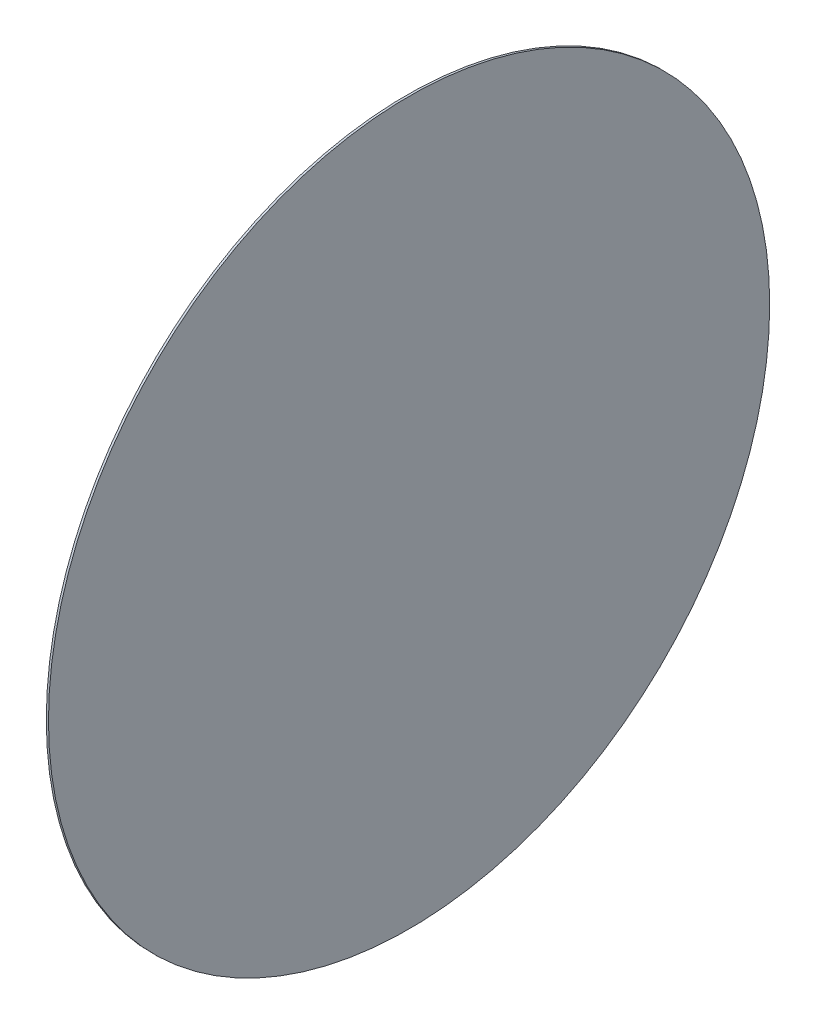
ISO-10303-21;
HEADER;
FILE_DESCRIPTION(('STEP AP214'),'2;1');
FILE_NAME('part.step','',(''),(''),'','','');
FILE_SCHEMA(('AUTOMOTIVE_DESIGN { 1 0 10303 214 1 1 1 1 }'));
ENDSEC;
DATA;
#1=APPLICATION_CONTEXT('core data for automotive mechanical design processes');
#2=APPLICATION_PROTOCOL_DEFINITION('international standard','automotive_design',2000,#1);
#3=PRODUCT_CONTEXT('',#1,'mechanical');
#4=PRODUCT('Part','Part','',(#3));
#5=PRODUCT_RELATED_PRODUCT_CATEGORY('part','',(#4));
#6=PRODUCT_DEFINITION_FORMATION('','',#4);
#7=PRODUCT_DEFINITION_CONTEXT('part definition',#1,'design');
#8=PRODUCT_DEFINITION('design','',#6,#7);
#9=PRODUCT_DEFINITION_SHAPE('','',#8);
#10=(LENGTH_UNIT() NAMED_UNIT(*) SI_UNIT(.MILLI.,.METRE.));
#11=(NAMED_UNIT(*) PLANE_ANGLE_UNIT() SI_UNIT($,.RADIAN.));
#12=(NAMED_UNIT(*) SI_UNIT($,.STERADIAN.) SOLID_ANGLE_UNIT());
#13=UNCERTAINTY_MEASURE_WITH_UNIT(LENGTH_MEASURE(1.E-05),#10,'distance_accuracy_value','');
#14=(GEOMETRIC_REPRESENTATION_CONTEXT(3) GLOBAL_UNCERTAINTY_ASSIGNED_CONTEXT((#13)) GLOBAL_UNIT_ASSIGNED_CONTEXT((#10,
#11,#12)) REPRESENTATION_CONTEXT('',''));
#15=CARTESIAN_POINT('',(0.,0.,0.));
#16=DIRECTION('',(0.,0.,1.));
#17=DIRECTION('',(1.,0.,0.));
#18=AXIS2_PLACEMENT_3D('',#15,#16,#17);
#19=CARTESIAN_POINT('',(0.,0.,0.));
#20=DIRECTION('',(-1.,0.,0.));
#21=DIRECTION('',(0.,0.,1.));
#22=AXIS2_PLACEMENT_3D('',#19,#20,#21);
#23=CYLINDRICAL_SURFACE('',#22,9.);
#24=CARTESIAN_POINT('',(0.,0.,0.));
#25=DIRECTION('',(-1.,0.,0.));
#26=DIRECTION('',(0.,0.,1.));
#27=AXIS2_PLACEMENT_3D('',#24,#25,#26);
#28=CIRCLE('',#27,9.);
#29=CARTESIAN_POINT('',(0.,0.,9.));
#30=VERTEX_POINT('',#29);
#31=EDGE_CURVE('E44',#30,#30,#28,.T.);
#32=ORIENTED_EDGE('',*,*,#31,.F.);
#33=EDGE_LOOP('',(#32));
#34=FACE_BOUND('',#33,.T.);
#35=CARTESIAN_POINT('',(0.0539999999999988,0.,0.));
#36=DIRECTION('',(-1.,0.,0.));
#37=DIRECTION('',(0.,0.,1.));
#38=AXIS2_PLACEMENT_3D('',#35,#36,#37);
#39=CIRCLE('',#38,9.);
#40=CARTESIAN_POINT('',(0.0539999999999988,0.,9.));
#41=VERTEX_POINT('',#40);
#42=EDGE_CURVE('E10',#41,#41,#39,.T.);
#43=ORIENTED_EDGE('',*,*,#42,.T.);
#44=EDGE_LOOP('',(#43));
#45=FACE_BOUND('',#44,.T.);
#46=ADVANCED_FACE('F37',(#34,#45),#23,.T.);
#47=CARTESIAN_POINT('',(0.0539999999999994,9.,0.));
#48=DIRECTION('',(-1.,0.,0.));
#49=DIRECTION('',(0.,0.,1.));
#50=AXIS2_PLACEMENT_3D('',#47,#48,#49);
#51=PLANE('',#50);
#52=ORIENTED_EDGE('',*,*,#42,.F.);
#53=EDGE_LOOP('',(#52));
#54=FACE_BOUND('',#53,.T.);
#55=ADVANCED_FACE('F54',(#54),#51,.F.);
#56=CARTESIAN_POINT('',(0.,9.,0.));
#57=DIRECTION('',(1.,0.,0.));
#58=DIRECTION('',(0.,0.,-1.));
#59=AXIS2_PLACEMENT_3D('',#56,#57,#58);
#60=PLANE('',#59);
#61=ORIENTED_EDGE('',*,*,#31,.T.);
#62=EDGE_LOOP('',(#61));
#63=FACE_BOUND('',#62,.T.);
#64=ADVANCED_FACE('F51',(#63),#60,.F.);
#65=CLOSED_SHELL('',(#46,#55,#64));
#66=MANIFOLD_SOLID_BREP('B2',#65);
#67=ADVANCED_BREP_SHAPE_REPRESENTATION('',(#18,#66),#14);
#68=SHAPE_DEFINITION_REPRESENTATION(#9,#67);
ENDSEC;
END-ISO-10303-21;
